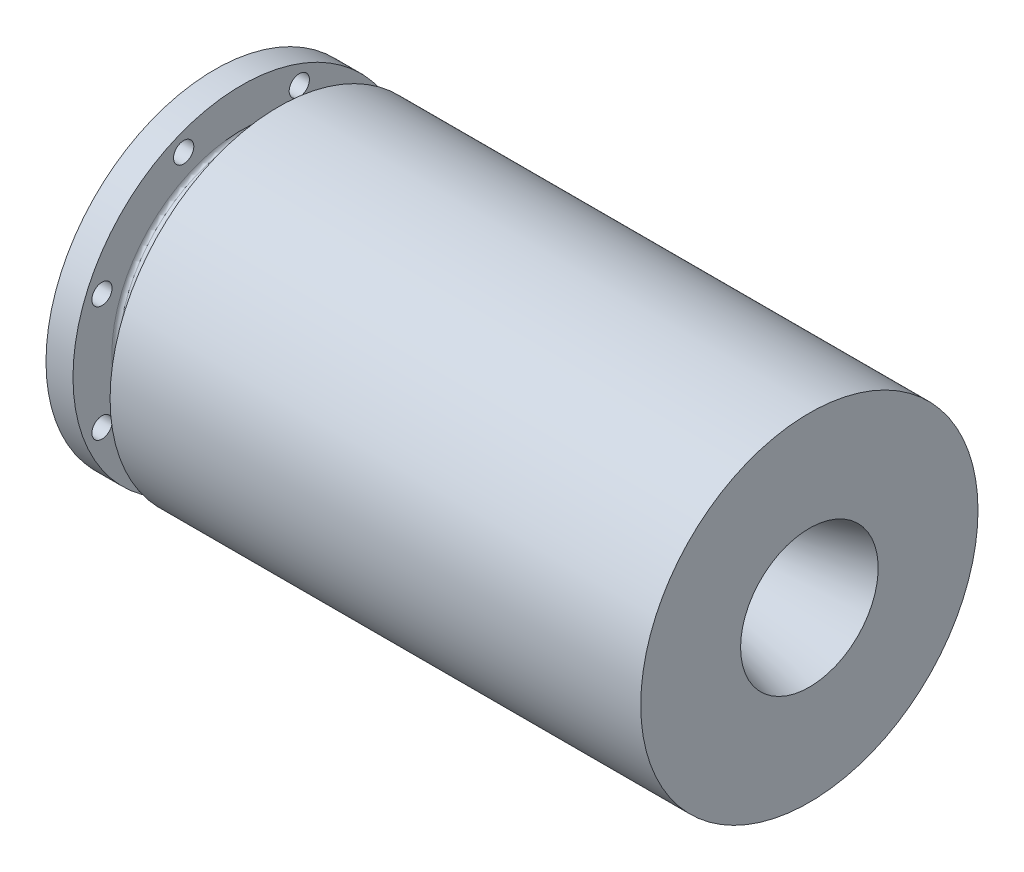
ISO-10303-21;
HEADER;
FILE_DESCRIPTION(('STEP AP214'),'2;1');
FILE_NAME('part.step','',(''),(''),'','','');
FILE_SCHEMA(('AUTOMOTIVE_DESIGN { 1 0 10303 214 1 1 1 1 }'));
ENDSEC;
DATA;
#1=APPLICATION_CONTEXT('core data for automotive mechanical design processes');
#2=APPLICATION_PROTOCOL_DEFINITION('international standard','automotive_design',2000,#1);
#3=PRODUCT_CONTEXT('',#1,'mechanical');
#4=PRODUCT('Part','Part','',(#3));
#5=PRODUCT_RELATED_PRODUCT_CATEGORY('part','',(#4));
#6=PRODUCT_DEFINITION_FORMATION('','',#4);
#7=PRODUCT_DEFINITION_CONTEXT('part definition',#1,'design');
#8=PRODUCT_DEFINITION('design','',#6,#7);
#9=PRODUCT_DEFINITION_SHAPE('','',#8);
#10=(LENGTH_UNIT() NAMED_UNIT(*) SI_UNIT(.MILLI.,.METRE.));
#11=(NAMED_UNIT(*) PLANE_ANGLE_UNIT() SI_UNIT($,.RADIAN.));
#12=(NAMED_UNIT(*) SI_UNIT($,.STERADIAN.) SOLID_ANGLE_UNIT());
#13=UNCERTAINTY_MEASURE_WITH_UNIT(LENGTH_MEASURE(1.E-05),#10,'distance_accuracy_value','');
#14=(GEOMETRIC_REPRESENTATION_CONTEXT(3) GLOBAL_UNCERTAINTY_ASSIGNED_CONTEXT((#13)) GLOBAL_UNIT_ASSIGNED_CONTEXT((#10,
#11,#12)) REPRESENTATION_CONTEXT('',''));
#15=CARTESIAN_POINT('',(0.,0.,0.));
#16=DIRECTION('',(0.,0.,1.));
#17=DIRECTION('',(1.,0.,0.));
#18=AXIS2_PLACEMENT_3D('',#15,#16,#17);
#19=CARTESIAN_POINT('',(0.,0.,0.));
#20=DIRECTION('',(-1.,0.,0.));
#21=DIRECTION('',(0.,0.,1.));
#22=AXIS2_PLACEMENT_3D('',#19,#20,#21);
#23=CYLINDRICAL_SURFACE('',#22,47.5996);
#24=CARTESIAN_POINT('',(22.86,0.,0.));
#25=DIRECTION('',(1.,0.,0.));
#26=DIRECTION('',(0.,0.,-1.));
#27=AXIS2_PLACEMENT_3D('',#24,#25,#26);
#28=CIRCLE('',#27,47.5996);
#29=CARTESIAN_POINT('',(22.86,0.,-47.5996));
#30=VERTEX_POINT('',#29);
#31=EDGE_CURVE('E62',#30,#30,#28,.F.);
#32=ORIENTED_EDGE('',*,*,#31,.T.);
#33=EDGE_LOOP('',(#32));
#34=FACE_BOUND('',#33,.T.);
#35=CARTESIAN_POINT('',(11.43,0.,0.));
#36=DIRECTION('',(-1.,0.,0.));
#37=DIRECTION('',(0.,0.,1.));
#38=AXIS2_PLACEMENT_3D('',#35,#36,#37);
#39=CIRCLE('',#38,47.5996);
#40=CARTESIAN_POINT('',(11.43,0.,47.5996));
#41=VERTEX_POINT('',#40);
#42=EDGE_CURVE('E65',#41,#41,#39,.F.);
#43=ORIENTED_EDGE('',*,*,#42,.T.);
#44=EDGE_LOOP('',(#43));
#45=FACE_BOUND('',#44,.T.);
#46=ADVANCED_FACE('F36',(#34,#45),#23,.T.);
#47=CARTESIAN_POINT('',(10.16,63.5,0.));
#48=DIRECTION('',(-1.,0.,0.));
#49=DIRECTION('',(0.,0.,1.));
#50=AXIS2_PLACEMENT_3D('',#47,#48,#49);
#51=PLANE('',#50);
#52=CARTESIAN_POINT('',(10.16,52.5460292053547,21.8190199310146));
#53=DIRECTION('',(-1.,0.,0.));
#54=DIRECTION('',(0.,0.,1.));
#55=AXIS2_PLACEMENT_3D('',#52,#53,#54);
#56=CIRCLE('',#55,3.81);
#57=CARTESIAN_POINT('',(10.16,52.5460292053547,25.6290199310146));
#58=VERTEX_POINT('',#57);
#59=EDGE_CURVE('E105',#58,#58,#56,.F.);
#60=ORIENTED_EDGE('',*,*,#59,.F.);
#61=EDGE_LOOP('',(#60));
#62=FACE_BOUND('',#61,.T.);
#63=CARTESIAN_POINT('',(10.16,21.7272766234677,52.5840305275976));
#64=DIRECTION('',(-1.,0.,0.));
#65=DIRECTION('',(0.,0.,1.));
#66=AXIS2_PLACEMENT_3D('',#63,#64,#65);
#67=CIRCLE('',#66,3.81);
#68=CARTESIAN_POINT('',(10.16,21.7272766234677,56.3940305275976));
#69=VERTEX_POINT('',#68);
#70=EDGE_CURVE('E141',#69,#69,#67,.F.);
#71=ORIENTED_EDGE('',*,*,#70,.F.);
#72=EDGE_LOOP('',(#71));
#73=FACE_BOUND('',#72,.T.);
#74=CARTESIAN_POINT('',(10.16,-21.8190199310148,52.5460292053546));
#75=DIRECTION('',(-1.,0.,0.));
#76=DIRECTION('',(0.,0.,1.));
#77=AXIS2_PLACEMENT_3D('',#74,#75,#76);
#78=CIRCLE('',#77,3.81);
#79=CARTESIAN_POINT('',(10.16,-21.8190199310148,56.3560292053546));
#80=VERTEX_POINT('',#79);
#81=EDGE_CURVE('E135',#80,#80,#78,.F.);
#82=ORIENTED_EDGE('',*,*,#81,.F.);
#83=EDGE_LOOP('',(#82));
#84=FACE_BOUND('',#83,.T.);
#85=CARTESIAN_POINT('',(10.16,-52.5840305275975,21.7272766234679));
#86=DIRECTION('',(-1.,0.,0.));
#87=DIRECTION('',(0.,0.,1.));
#88=AXIS2_PLACEMENT_3D('',#85,#86,#87);
#89=CIRCLE('',#88,3.81);
#90=CARTESIAN_POINT('',(10.16,-52.5840305275975,25.5372766234679));
#91=VERTEX_POINT('',#90);
#92=EDGE_CURVE('E129',#91,#91,#89,.F.);
#93=ORIENTED_EDGE('',*,*,#92,.F.);
#94=EDGE_LOOP('',(#93));
#95=FACE_BOUND('',#94,.T.);
#96=CARTESIAN_POINT('',(10.16,-52.5460292053545,-21.819019931015));
#97=DIRECTION('',(-1.,0.,0.));
#98=DIRECTION('',(0.,0.,1.));
#99=AXIS2_PLACEMENT_3D('',#96,#97,#98);
#100=CIRCLE('',#99,3.81);
#101=CARTESIAN_POINT('',(10.16,-52.5460292053545,-18.009019931015));
#102=VERTEX_POINT('',#101);
#103=EDGE_CURVE('E123',#102,#102,#100,.F.);
#104=ORIENTED_EDGE('',*,*,#103,.F.);
#105=EDGE_LOOP('',(#104));
#106=FACE_BOUND('',#105,.T.);
#107=CARTESIAN_POINT('',(10.16,-21.7272766234673,-52.5840305275977));
#108=DIRECTION('',(-1.,0.,0.));
#109=DIRECTION('',(0.,0.,1.));
#110=AXIS2_PLACEMENT_3D('',#107,#108,#109);
#111=CIRCLE('',#110,3.81);
#112=CARTESIAN_POINT('',(10.16,-21.7272766234673,-48.7740305275977));
#113=VERTEX_POINT('',#112);
#114=EDGE_CURVE('E117',#113,#113,#111,.F.);
#115=ORIENTED_EDGE('',*,*,#114,.F.);
#116=EDGE_LOOP('',(#115));
#117=FACE_BOUND('',#116,.T.);
#118=CARTESIAN_POINT('',(10.16,21.8190199310152,-52.5460292053544));
#119=DIRECTION('',(-1.,0.,0.));
#120=DIRECTION('',(0.,0.,1.));
#121=AXIS2_PLACEMENT_3D('',#118,#119,#120);
#122=CIRCLE('',#121,3.81);
#123=CARTESIAN_POINT('',(10.16,21.8190199310152,-48.7360292053544));
#124=VERTEX_POINT('',#123);
#125=EDGE_CURVE('E111',#124,#124,#122,.F.);
#126=ORIENTED_EDGE('',*,*,#125,.F.);
#127=EDGE_LOOP('',(#126));
#128=FACE_BOUND('',#127,.T.);
#129=CARTESIAN_POINT('',(10.16,52.5840305275975,-21.7272766234679));
#130=DIRECTION('',(-1.,0.,0.));
#131=DIRECTION('',(0.,0.,1.));
#132=AXIS2_PLACEMENT_3D('',#129,#130,#131);
#133=CIRCLE('',#132,3.81);
#134=CARTESIAN_POINT('',(10.16,52.5840305275975,-17.9172766234679));
#135=VERTEX_POINT('',#134);
#136=EDGE_CURVE('E101',#135,#135,#133,.F.);
#137=ORIENTED_EDGE('',*,*,#136,.F.);
#138=EDGE_LOOP('',(#137));
#139=FACE_BOUND('',#138,.T.);
#140=CARTESIAN_POINT('',(10.16,0.,0.));
#141=DIRECTION('',(-1.,0.,0.));
#142=DIRECTION('',(0.,0.,1.));
#143=AXIS2_PLACEMENT_3D('',#140,#141,#142);
#144=CIRCLE('',#143,48.8696);
#145=CARTESIAN_POINT('',(10.16,0.,48.8696));
#146=VERTEX_POINT('',#145);
#147=EDGE_CURVE('E56',#146,#146,#144,.T.);
#148=ORIENTED_EDGE('',*,*,#147,.T.);
#149=EDGE_LOOP('',(#148));
#150=FACE_BOUND('',#149,.T.);
#151=CARTESIAN_POINT('',(10.16,0.,0.));
#152=DIRECTION('',(-1.,0.,0.));
#153=DIRECTION('',(0.,0.,1.));
#154=AXIS2_PLACEMENT_3D('',#151,#152,#153);
#155=CIRCLE('',#154,63.5);
#156=CARTESIAN_POINT('',(10.16,0.,63.5));
#157=VERTEX_POINT('',#156);
#158=EDGE_CURVE('E68',#157,#157,#155,.T.);
#159=ORIENTED_EDGE('',*,*,#158,.F.);
#160=EDGE_LOOP('',(#159));
#161=FACE_BOUND('',#160,.T.);
#162=ADVANCED_FACE('F152',(#62,#73,#84,#95,#106,#117,#128,#139,#150,#161),#51,.F.);
#163=CARTESIAN_POINT('',(0.,0.,0.));
#164=DIRECTION('',(-1.,0.,0.));
#165=DIRECTION('',(0.,0.,1.));
#166=AXIS2_PLACEMENT_3D('',#163,#164,#165);
#167=CYLINDRICAL_SURFACE('',#166,63.5);
#168=CARTESIAN_POINT('',(0.,0.,0.));
#169=DIRECTION('',(-1.,0.,0.));
#170=DIRECTION('',(0.,0.,1.));
#171=AXIS2_PLACEMENT_3D('',#168,#169,#170);
#172=CIRCLE('',#171,63.5);
#173=CARTESIAN_POINT('',(0.,0.,63.5));
#174=VERTEX_POINT('',#173);
#175=EDGE_CURVE('E71',#174,#174,#172,.T.);
#176=ORIENTED_EDGE('',*,*,#175,.F.);
#177=EDGE_LOOP('',(#176));
#178=FACE_BOUND('',#177,.T.);
#179=ORIENTED_EDGE('',*,*,#158,.T.);
#180=EDGE_LOOP('',(#179));
#181=FACE_BOUND('',#180,.T.);
#182=ADVANCED_FACE('F155',(#178,#181),#167,.T.);
#183=CARTESIAN_POINT('',(0.,48.5902,0.));
#184=DIRECTION('',(1.,0.,0.));
#185=DIRECTION('',(0.,0.,-1.));
#186=AXIS2_PLACEMENT_3D('',#183,#184,#185);
#187=PLANE('',#186);
#188=CARTESIAN_POINT('',(0.,52.5460292053547,21.8190199310146));
#189=DIRECTION('',(-1.,0.,0.));
#190=DIRECTION('',(0.,-0.707106781186549,0.707106781186546));
#191=AXIS2_PLACEMENT_3D('',#188,#189,#190);
#192=CIRCLE('',#191,3.81);
#193=CARTESIAN_POINT('',(0.,49.8519523690339,24.5130967673354));
#194=VERTEX_POINT('',#193);
#195=EDGE_CURVE('E144',#194,#194,#192,.T.);
#196=ORIENTED_EDGE('',*,*,#195,.F.);
#197=EDGE_LOOP('',(#196));
#198=FACE_BOUND('',#197,.T.);
#199=CARTESIAN_POINT('',(0.,21.7272766234677,52.5840305275976));
#200=DIRECTION('',(-1.,0.,0.));
#201=DIRECTION('',(0.,-1.,0.));
#202=AXIS2_PLACEMENT_3D('',#199,#200,#201);
#203=CIRCLE('',#202,3.81);
#204=CARTESIAN_POINT('',(0.,17.9172766234677,52.5840305275976));
#205=VERTEX_POINT('',#204);
#206=EDGE_CURVE('E138',#205,#205,#203,.T.);
#207=ORIENTED_EDGE('',*,*,#206,.F.);
#208=EDGE_LOOP('',(#207));
#209=FACE_BOUND('',#208,.T.);
#210=CARTESIAN_POINT('',(0.,-21.8190199310148,52.5460292053546));
#211=DIRECTION('',(-1.,0.,0.));
#212=DIRECTION('',(0.,-0.707106781186544,-0.707106781186551));
#213=AXIS2_PLACEMENT_3D('',#210,#211,#212);
#214=CIRCLE('',#213,3.81);
#215=CARTESIAN_POINT('',(0.,-24.5130967673356,49.8519523690338));
#216=VERTEX_POINT('',#215);
#217=EDGE_CURVE('E132',#216,#216,#214,.T.);
#218=ORIENTED_EDGE('',*,*,#217,.F.);
#219=EDGE_LOOP('',(#218));
#220=FACE_BOUND('',#219,.T.);
#221=CARTESIAN_POINT('',(0.,-52.5840305275975,21.7272766234679));
#222=DIRECTION('',(-1.,0.,0.));
#223=DIRECTION('',(0.,0.,-1.));
#224=AXIS2_PLACEMENT_3D('',#221,#222,#223);
#225=CIRCLE('',#224,3.81);
#226=CARTESIAN_POINT('',(0.,-52.5840305275975,17.9172766234679));
#227=VERTEX_POINT('',#226);
#228=EDGE_CURVE('E126',#227,#227,#225,.T.);
#229=ORIENTED_EDGE('',*,*,#228,.F.);
#230=EDGE_LOOP('',(#229));
#231=FACE_BOUND('',#230,.T.);
#232=CARTESIAN_POINT('',(0.,-52.5460292053545,-21.819019931015));
#233=DIRECTION('',(-1.,0.,0.));
#234=DIRECTION('',(0.,0.707106781186554,-0.707106781186541));
#235=AXIS2_PLACEMENT_3D('',#232,#233,#234);
#236=CIRCLE('',#235,3.81);
#237=CARTESIAN_POINT('',(0.,-49.8519523690338,-24.5130967673357));
#238=VERTEX_POINT('',#237);
#239=EDGE_CURVE('E120',#238,#238,#236,.T.);
#240=ORIENTED_EDGE('',*,*,#239,.F.);
#241=EDGE_LOOP('',(#240));
#242=FACE_BOUND('',#241,.T.);
#243=CARTESIAN_POINT('',(0.,-21.7272766234673,-52.5840305275977));
#244=DIRECTION('',(-1.,0.,0.));
#245=DIRECTION('',(0.,1.,0.));
#246=AXIS2_PLACEMENT_3D('',#243,#244,#245);
#247=CIRCLE('',#246,3.81);
#248=CARTESIAN_POINT('',(0.,-17.9172766234673,-52.5840305275977));
#249=VERTEX_POINT('',#248);
#250=EDGE_CURVE('E114',#249,#249,#247,.T.);
#251=ORIENTED_EDGE('',*,*,#250,.F.);
#252=EDGE_LOOP('',(#251));
#253=FACE_BOUND('',#252,.T.);
#254=CARTESIAN_POINT('',(0.,21.8190199310152,-52.5460292053544));
#255=DIRECTION('',(-1.,0.,0.));
#256=DIRECTION('',(0.,0.707106781186539,0.707106781186556));
#257=AXIS2_PLACEMENT_3D('',#254,#255,#256);
#258=CIRCLE('',#257,3.81);
#259=CARTESIAN_POINT('',(0.,24.5130967673359,-49.8519523690337));
#260=VERTEX_POINT('',#259);
#261=EDGE_CURVE('E108',#260,#260,#258,.T.);
#262=ORIENTED_EDGE('',*,*,#261,.F.);
#263=EDGE_LOOP('',(#262));
#264=FACE_BOUND('',#263,.T.);
#265=CARTESIAN_POINT('',(0.,52.5840305275975,-21.7272766234679));
#266=DIRECTION('',(-1.,0.,0.));
#267=DIRECTION('',(0.,0.,1.));
#268=AXIS2_PLACEMENT_3D('',#265,#266,#267);
#269=CIRCLE('',#268,3.81);
#270=CARTESIAN_POINT('',(0.,52.5840305275975,-17.9172766234679));
#271=VERTEX_POINT('',#270);
#272=EDGE_CURVE('E102',#271,#271,#269,.T.);
#273=ORIENTED_EDGE('',*,*,#272,.F.);
#274=EDGE_LOOP('',(#273));
#275=FACE_BOUND('',#274,.T.);
#276=CARTESIAN_POINT('',(0.,0.,0.));
#277=DIRECTION('',(-1.,0.,0.));
#278=DIRECTION('',(0.,0.,1.));
#279=AXIS2_PLACEMENT_3D('',#276,#277,#278);
#280=CIRCLE('',#279,48.5902);
#281=CARTESIAN_POINT('',(0.,0.,48.5902));
#282=VERTEX_POINT('',#281);
#283=EDGE_CURVE('E74',#282,#282,#280,.T.);
#284=ORIENTED_EDGE('',*,*,#283,.F.);
#285=EDGE_LOOP('',(#284));
#286=FACE_BOUND('',#285,.T.);
#287=ORIENTED_EDGE('',*,*,#175,.T.);
#288=EDGE_LOOP('',(#287));
#289=FACE_BOUND('',#288,.T.);
#290=ADVANCED_FACE('F176',(#198,#209,#220,#231,#242,#253,#264,#275,#286,#289),#187,.F.);
#291=CARTESIAN_POINT('',(0.,0.,0.));
#292=DIRECTION('',(-1.,0.,0.));
#293=DIRECTION('',(0.,0.,1.));
#294=AXIS2_PLACEMENT_3D('',#291,#292,#293);
#295=CYLINDRICAL_SURFACE('',#294,48.5902);
#296=CARTESIAN_POINT('',(2.9718,0.,0.));
#297=DIRECTION('',(1.,0.,0.));
#298=DIRECTION('',(0.,0.,-1.));
#299=AXIS2_PLACEMENT_3D('',#296,#297,#298);
#300=CIRCLE('',#299,48.5902);
#301=CARTESIAN_POINT('',(2.9718,0.,-48.5902));
#302=VERTEX_POINT('',#301);
#303=EDGE_CURVE('E10',#302,#302,#300,.T.);
#304=ORIENTED_EDGE('',*,*,#303,.T.);
#305=EDGE_LOOP('',(#304));
#306=FACE_BOUND('',#305,.T.);
#307=ORIENTED_EDGE('',*,*,#283,.T.);
#308=EDGE_LOOP('',(#307));
#309=FACE_BOUND('',#308,.T.);
#310=ADVANCED_FACE('F182',(#306,#309),#295,.F.);
#311=CARTESIAN_POINT('',(3.8608,48.5902,0.));
#312=DIRECTION('',(1.,0.,0.));
#313=DIRECTION('',(0.,0.,-1.));
#314=AXIS2_PLACEMENT_3D('',#311,#312,#313);
#315=PLANE('',#314);
#316=CARTESIAN_POINT('',(3.8608,0.,0.));
#317=DIRECTION('',(1.,0.,0.));
#318=DIRECTION('',(0.,0.,-1.));
#319=AXIS2_PLACEMENT_3D('',#316,#317,#318);
#320=CIRCLE('',#319,43.4086);
#321=CARTESIAN_POINT('',(3.8608,0.,-43.4086));
#322=VERTEX_POINT('',#321);
#323=EDGE_CURVE('E43',#322,#322,#320,.T.);
#324=ORIENTED_EDGE('',*,*,#323,.T.);
#325=EDGE_LOOP('',(#324));
#326=FACE_BOUND('',#325,.T.);
#327=CARTESIAN_POINT('',(3.8608,0.,0.));
#328=DIRECTION('',(1.,0.,0.));
#329=DIRECTION('',(0.,0.,-1.));
#330=AXIS2_PLACEMENT_3D('',#327,#328,#329);
#331=CIRCLE('',#330,47.7012);
#332=CARTESIAN_POINT('',(3.8608,0.,-47.7012));
#333=VERTEX_POINT('',#332);
#334=EDGE_CURVE('E47',#333,#333,#331,.F.);
#335=ORIENTED_EDGE('',*,*,#334,.T.);
#336=EDGE_LOOP('',(#335));
#337=FACE_BOUND('',#336,.T.);
#338=ADVANCED_FACE('F220',(#326,#337),#315,.F.);
#339=CARTESIAN_POINT('',(0.,0.,0.));
#340=DIRECTION('',(-1.,0.,0.));
#341=DIRECTION('',(0.,0.,1.));
#342=AXIS2_PLACEMENT_3D('',#339,#340,#341);
#343=CYLINDRICAL_SURFACE('',#342,42.5196);
#344=CARTESIAN_POINT('',(2.9718,0.,0.));
#345=DIRECTION('',(1.,0.,0.));
#346=DIRECTION('',(0.,0.,-1.));
#347=AXIS2_PLACEMENT_3D('',#344,#345,#346);
#348=CIRCLE('',#347,42.5196);
#349=CARTESIAN_POINT('',(2.9718,0.,-42.5196));
#350=VERTEX_POINT('',#349);
#351=EDGE_CURVE('E51',#350,#350,#348,.F.);
#352=ORIENTED_EDGE('',*,*,#351,.T.);
#353=EDGE_LOOP('',(#352));
#354=FACE_BOUND('',#353,.T.);
#355=CARTESIAN_POINT('',(0.,0.,0.));
#356=DIRECTION('',(-1.,0.,0.));
#357=DIRECTION('',(0.,0.,1.));
#358=AXIS2_PLACEMENT_3D('',#355,#356,#357);
#359=CIRCLE('',#358,42.5196);
#360=CARTESIAN_POINT('',(0.,0.,42.5196));
#361=VERTEX_POINT('',#360);
#362=EDGE_CURVE('E77',#361,#361,#359,.T.);
#363=ORIENTED_EDGE('',*,*,#362,.F.);
#364=EDGE_LOOP('',(#363));
#365=FACE_BOUND('',#364,.T.);
#366=ADVANCED_FACE('F216',(#354,#365),#343,.T.);
#367=CARTESIAN_POINT('',(0.,33.8836,0.));
#368=DIRECTION('',(1.,0.,0.));
#369=DIRECTION('',(0.,0.,-1.));
#370=AXIS2_PLACEMENT_3D('',#367,#368,#369);
#371=PLANE('',#370);
#372=CARTESIAN_POINT('',(0.,0.,0.));
#373=DIRECTION('',(-1.,0.,0.));
#374=DIRECTION('',(0.,0.,1.));
#375=AXIS2_PLACEMENT_3D('',#372,#373,#374);
#376=CIRCLE('',#375,33.8836);
#377=CARTESIAN_POINT('',(0.,0.,33.8836));
#378=VERTEX_POINT('',#377);
#379=EDGE_CURVE('E80',#378,#378,#376,.T.);
#380=ORIENTED_EDGE('',*,*,#379,.F.);
#381=EDGE_LOOP('',(#380));
#382=FACE_BOUND('',#381,.T.);
#383=ORIENTED_EDGE('',*,*,#362,.T.);
#384=EDGE_LOOP('',(#383));
#385=FACE_BOUND('',#384,.T.);
#386=ADVANCED_FACE('F219',(#382,#385),#371,.F.);
#387=CARTESIAN_POINT('',(0.,0.,0.));
#388=DIRECTION('',(-1.,0.,0.));
#389=DIRECTION('',(0.,0.,1.));
#390=AXIS2_PLACEMENT_3D('',#387,#388,#389);
#391=CYLINDRICAL_SURFACE('',#390,33.8836);
#392=CARTESIAN_POINT('',(173.5582,0.,0.));
#393=DIRECTION('',(-1.,0.,0.));
#394=DIRECTION('',(0.,0.,1.));
#395=AXIS2_PLACEMENT_3D('',#392,#393,#394);
#396=CIRCLE('',#395,33.8836);
#397=CARTESIAN_POINT('',(173.5582,0.,33.8836));
#398=VERTEX_POINT('',#397);
#399=EDGE_CURVE('E83',#398,#398,#396,.T.);
#400=ORIENTED_EDGE('',*,*,#399,.F.);
#401=EDGE_LOOP('',(#400));
#402=FACE_BOUND('',#401,.T.);
#403=ORIENTED_EDGE('',*,*,#379,.T.);
#404=EDGE_LOOP('',(#403));
#405=FACE_BOUND('',#404,.T.);
#406=ADVANCED_FACE('F225',(#402,#405),#391,.F.);
#407=CARTESIAN_POINT('',(173.5582,0.,0.));
#408=DIRECTION('',(-1.,0.,0.));
#409=DIRECTION('',(0.,0.,1.));
#410=AXIS2_PLACEMENT_3D('',#407,#408,#409);
#411=CONICAL_SURFACE('',#410,33.8836,0.785398163397442);
#412=CARTESIAN_POINT('',(189.463049342222,0.,0.));
#413=DIRECTION('',(-1.,0.,0.));
#414=DIRECTION('',(0.,0.,1.));
#415=AXIS2_PLACEMENT_3D('',#412,#413,#414);
#416=CIRCLE('',#415,17.9787506577782);
#417=CARTESIAN_POINT('',(189.463049342222,0.,17.9787506577782));
#418=VERTEX_POINT('',#417);
#419=EDGE_CURVE('E86',#418,#418,#416,.T.);
#420=ORIENTED_EDGE('',*,*,#419,.F.);
#421=EDGE_LOOP('',(#420));
#422=FACE_BOUND('',#421,.T.);
#423=ORIENTED_EDGE('',*,*,#399,.T.);
#424=EDGE_LOOP('',(#423));
#425=FACE_BOUND('',#424,.T.);
#426=ADVANCED_FACE('F231',(#422,#425),#411,.F.);
#427=CARTESIAN_POINT('',(191.259100566436,0.,0.));
#428=DIRECTION('',(-1.,0.,0.));
#429=DIRECTION('',(0.,0.,1.));
#430=AXIS2_PLACEMENT_3D('',#427,#428,#429);
#431=TOROIDAL_SURFACE('',#430,19.774801881992,2.54);
#432=CARTESIAN_POINT('',(191.916500940996,0.,0.));
#433=DIRECTION('',(-1.,0.,0.));
#434=DIRECTION('',(0.,0.,1.));
#435=AXIS2_PLACEMENT_3D('',#432,#433,#434);
#436=CIRCLE('',#435,17.3213502832178);
#437=CARTESIAN_POINT('',(191.916500940996,0.,17.3213502832178));
#438=VERTEX_POINT('',#437);
#439=EDGE_CURVE('E89',#438,#438,#436,.T.);
#440=ORIENTED_EDGE('',*,*,#439,.F.);
#441=EDGE_LOOP('',(#440));
#442=FACE_BOUND('',#441,.T.);
#443=ORIENTED_EDGE('',*,*,#419,.T.);
#444=EDGE_LOOP('',(#443));
#445=FACE_BOUND('',#444,.T.);
#446=ADVANCED_FACE('F282',(#442,#445),#431,.T.);
#447=CARTESIAN_POINT('',(191.916500940996,0.,0.));
#448=DIRECTION('',(1.,0.,0.));
#449=DIRECTION('',(0.,0.,-1.));
#450=AXIS2_PLACEMENT_3D('',#447,#448,#449);
#451=CONICAL_SURFACE('',#450,17.3213502832178,0.26179938779915);
#452=CARTESIAN_POINT('',(223.962313950824,0.,0.));
#453=DIRECTION('',(-1.,0.,0.));
#454=DIRECTION('',(0.,0.,1.));
#455=AXIS2_PLACEMENT_3D('',#452,#453,#454);
#456=CIRCLE('',#455,25.908);
#457=CARTESIAN_POINT('',(223.962313950824,0.,25.908));
#458=VERTEX_POINT('',#457);
#459=EDGE_CURVE('E92',#458,#458,#456,.T.);
#460=ORIENTED_EDGE('',*,*,#459,.F.);
#461=EDGE_LOOP('',(#460));
#462=FACE_BOUND('',#461,.T.);
#463=ORIENTED_EDGE('',*,*,#439,.T.);
#464=EDGE_LOOP('',(#463));
#465=FACE_BOUND('',#464,.T.);
#466=ADVANCED_FACE('F292',(#462,#465),#451,.F.);
#467=CARTESIAN_POINT('',(223.962313950824,63.5,0.));
#468=DIRECTION('',(-1.,0.,0.));
#469=DIRECTION('',(0.,0.,1.));
#470=AXIS2_PLACEMENT_3D('',#467,#468,#469);
#471=PLANE('',#470);
#472=CARTESIAN_POINT('',(223.962313950824,0.,0.));
#473=DIRECTION('',(-1.,0.,0.));
#474=DIRECTION('',(0.,0.,1.));
#475=AXIS2_PLACEMENT_3D('',#472,#473,#474);
#476=CIRCLE('',#475,63.5);
#477=CARTESIAN_POINT('',(223.962313950824,0.,63.5));
#478=VERTEX_POINT('',#477);
#479=EDGE_CURVE('E95',#478,#478,#476,.T.);
#480=ORIENTED_EDGE('',*,*,#479,.F.);
#481=EDGE_LOOP('',(#480));
#482=FACE_BOUND('',#481,.T.);
#483=ORIENTED_EDGE('',*,*,#459,.T.);
#484=EDGE_LOOP('',(#483));
#485=FACE_BOUND('',#484,.T.);
#486=ADVANCED_FACE('F303',(#482,#485),#471,.F.);
#487=CARTESIAN_POINT('',(0.,0.,0.));
#488=DIRECTION('',(-1.,0.,0.));
#489=DIRECTION('',(0.,0.,1.));
#490=AXIS2_PLACEMENT_3D('',#487,#488,#489);
#491=CYLINDRICAL_SURFACE('',#490,63.5);
#492=CARTESIAN_POINT('',(24.13,0.,0.));
#493=DIRECTION('',(-1.,0.,0.));
#494=DIRECTION('',(0.,0.,1.));
#495=AXIS2_PLACEMENT_3D('',#492,#493,#494);
#496=CIRCLE('',#495,63.5);
#497=CARTESIAN_POINT('',(24.13,0.,63.5));
#498=VERTEX_POINT('',#497);
#499=EDGE_CURVE('E98',#498,#498,#496,.T.);
#500=ORIENTED_EDGE('',*,*,#499,.F.);
#501=EDGE_LOOP('',(#500));
#502=FACE_BOUND('',#501,.T.);
#503=ORIENTED_EDGE('',*,*,#479,.T.);
#504=EDGE_LOOP('',(#503));
#505=FACE_BOUND('',#504,.T.);
#506=ADVANCED_FACE('F314',(#502,#505),#491,.T.);
#507=CARTESIAN_POINT('',(24.13,47.5996,0.));
#508=DIRECTION('',(1.,0.,0.));
#509=DIRECTION('',(0.,0.,-1.));
#510=AXIS2_PLACEMENT_3D('',#507,#508,#509);
#511=PLANE('',#510);
#512=CARTESIAN_POINT('',(24.13,0.,0.));
#513=DIRECTION('',(1.,0.,0.));
#514=DIRECTION('',(0.,0.,-1.));
#515=AXIS2_PLACEMENT_3D('',#512,#513,#514);
#516=CIRCLE('',#515,48.8696);
#517=CARTESIAN_POINT('',(24.13,0.,-48.8696));
#518=VERTEX_POINT('',#517);
#519=EDGE_CURVE('E59',#518,#518,#516,.T.);
#520=ORIENTED_EDGE('',*,*,#519,.T.);
#521=EDGE_LOOP('',(#520));
#522=FACE_BOUND('',#521,.T.);
#523=ORIENTED_EDGE('',*,*,#499,.T.);
#524=EDGE_LOOP('',(#523));
#525=FACE_BOUND('',#524,.T.);
#526=ADVANCED_FACE('F197',(#522,#525),#511,.F.);
#527=CARTESIAN_POINT('',(22.86,0.,0.));
#528=DIRECTION('',(1.,0.,0.));
#529=DIRECTION('',(0.,0.,-1.));
#530=AXIS2_PLACEMENT_3D('',#527,#528,#529);
#531=TOROIDAL_SURFACE('',#530,48.8696,1.27);
#532=ORIENTED_EDGE('',*,*,#519,.F.);
#533=EDGE_LOOP('',(#532));
#534=FACE_BOUND('',#533,.T.);
#535=ORIENTED_EDGE('',*,*,#31,.F.);
#536=EDGE_LOOP('',(#535));
#537=FACE_BOUND('',#536,.T.);
#538=ADVANCED_FACE('F193',(#534,#537),#531,.F.);
#539=CARTESIAN_POINT('',(11.43,0.,0.));
#540=DIRECTION('',(-1.,0.,0.));
#541=DIRECTION('',(0.,0.,1.));
#542=AXIS2_PLACEMENT_3D('',#539,#540,#541);
#543=TOROIDAL_SURFACE('',#542,48.8696,1.27);
#544=ORIENTED_EDGE('',*,*,#42,.F.);
#545=EDGE_LOOP('',(#544));
#546=FACE_BOUND('',#545,.T.);
#547=ORIENTED_EDGE('',*,*,#147,.F.);
#548=EDGE_LOOP('',(#547));
#549=FACE_BOUND('',#548,.T.);
#550=ADVANCED_FACE('F196',(#546,#549),#543,.F.);
#551=CARTESIAN_POINT('',(223.963313950824,52.5840305275975,-21.7272766234679));
#552=DIRECTION('',(-1.,0.,0.));
#553=DIRECTION('',(0.,0.,1.));
#554=AXIS2_PLACEMENT_3D('',#551,#552,#553);
#555=CYLINDRICAL_SURFACE('',#554,3.81);
#556=ORIENTED_EDGE('',*,*,#272,.T.);
#557=EDGE_LOOP('',(#556));
#558=FACE_BOUND('',#557,.T.);
#559=ORIENTED_EDGE('',*,*,#136,.T.);
#560=EDGE_LOOP('',(#559));
#561=FACE_BOUND('',#560,.T.);
#562=ADVANCED_FACE('F200',(#558,#561),#555,.F.);
#563=CARTESIAN_POINT('',(223.963313950824,21.8190199310152,-52.5460292053544));
#564=DIRECTION('',(-1.,0.,0.));
#565=DIRECTION('',(0.,0.,1.));
#566=AXIS2_PLACEMENT_3D('',#563,#564,#565);
#567=CYLINDRICAL_SURFACE('',#566,3.81);
#568=ORIENTED_EDGE('',*,*,#261,.T.);
#569=EDGE_LOOP('',(#568));
#570=FACE_BOUND('',#569,.T.);
#571=ORIENTED_EDGE('',*,*,#125,.T.);
#572=EDGE_LOOP('',(#571));
#573=FACE_BOUND('',#572,.T.);
#574=ADVANCED_FACE('F361',(#570,#573),#567,.F.);
#575=CARTESIAN_POINT('',(223.963313950824,-21.7272766234673,-52.5840305275977));
#576=DIRECTION('',(-1.,0.,0.));
#577=DIRECTION('',(0.,0.,1.));
#578=AXIS2_PLACEMENT_3D('',#575,#576,#577);
#579=CYLINDRICAL_SURFACE('',#578,3.81);
#580=ORIENTED_EDGE('',*,*,#250,.T.);
#581=EDGE_LOOP('',(#580));
#582=FACE_BOUND('',#581,.T.);
#583=ORIENTED_EDGE('',*,*,#114,.T.);
#584=EDGE_LOOP('',(#583));
#585=FACE_BOUND('',#584,.T.);
#586=ADVANCED_FACE('F372',(#582,#585),#579,.F.);
#587=CARTESIAN_POINT('',(223.963313950824,-52.5460292053545,-21.819019931015));
#588=DIRECTION('',(-1.,0.,0.));
#589=DIRECTION('',(0.,0.,1.));
#590=AXIS2_PLACEMENT_3D('',#587,#588,#589);
#591=CYLINDRICAL_SURFACE('',#590,3.81);
#592=ORIENTED_EDGE('',*,*,#239,.T.);
#593=EDGE_LOOP('',(#592));
#594=FACE_BOUND('',#593,.T.);
#595=ORIENTED_EDGE('',*,*,#103,.T.);
#596=EDGE_LOOP('',(#595));
#597=FACE_BOUND('',#596,.T.);
#598=ADVANCED_FACE('F383',(#594,#597),#591,.F.);
#599=CARTESIAN_POINT('',(223.963313950824,-52.5840305275975,21.7272766234679));
#600=DIRECTION('',(-1.,0.,0.));
#601=DIRECTION('',(0.,0.,1.));
#602=AXIS2_PLACEMENT_3D('',#599,#600,#601);
#603=CYLINDRICAL_SURFACE('',#602,3.81);
#604=ORIENTED_EDGE('',*,*,#228,.T.);
#605=EDGE_LOOP('',(#604));
#606=FACE_BOUND('',#605,.T.);
#607=ORIENTED_EDGE('',*,*,#92,.T.);
#608=EDGE_LOOP('',(#607));
#609=FACE_BOUND('',#608,.T.);
#610=ADVANCED_FACE('F394',(#606,#609),#603,.F.);
#611=CARTESIAN_POINT('',(223.963313950824,-21.8190199310148,52.5460292053546));
#612=DIRECTION('',(-1.,0.,0.));
#613=DIRECTION('',(0.,0.,1.));
#614=AXIS2_PLACEMENT_3D('',#611,#612,#613);
#615=CYLINDRICAL_SURFACE('',#614,3.81);
#616=ORIENTED_EDGE('',*,*,#217,.T.);
#617=EDGE_LOOP('',(#616));
#618=FACE_BOUND('',#617,.T.);
#619=ORIENTED_EDGE('',*,*,#81,.T.);
#620=EDGE_LOOP('',(#619));
#621=FACE_BOUND('',#620,.T.);
#622=ADVANCED_FACE('F405',(#618,#621),#615,.F.);
#623=CARTESIAN_POINT('',(223.963313950824,21.7272766234677,52.5840305275976));
#624=DIRECTION('',(-1.,0.,0.));
#625=DIRECTION('',(0.,0.,1.));
#626=AXIS2_PLACEMENT_3D('',#623,#624,#625);
#627=CYLINDRICAL_SURFACE('',#626,3.81);
#628=ORIENTED_EDGE('',*,*,#206,.T.);
#629=EDGE_LOOP('',(#628));
#630=FACE_BOUND('',#629,.T.);
#631=ORIENTED_EDGE('',*,*,#70,.T.);
#632=EDGE_LOOP('',(#631));
#633=FACE_BOUND('',#632,.T.);
#634=ADVANCED_FACE('F210',(#630,#633),#627,.F.);
#635=CARTESIAN_POINT('',(223.963313950824,52.5460292053547,21.8190199310146));
#636=DIRECTION('',(-1.,0.,0.));
#637=DIRECTION('',(0.,0.,1.));
#638=AXIS2_PLACEMENT_3D('',#635,#636,#637);
#639=CYLINDRICAL_SURFACE('',#638,3.81);
#640=ORIENTED_EDGE('',*,*,#195,.T.);
#641=EDGE_LOOP('',(#640));
#642=FACE_BOUND('',#641,.T.);
#643=ORIENTED_EDGE('',*,*,#59,.T.);
#644=EDGE_LOOP('',(#643));
#645=FACE_BOUND('',#644,.T.);
#646=ADVANCED_FACE('F150',(#642,#645),#639,.F.);
#647=CARTESIAN_POINT('',(2.9718,0.,0.));
#648=DIRECTION('',(1.,0.,0.));
#649=DIRECTION('',(0.,0.,-1.));
#650=AXIS2_PLACEMENT_3D('',#647,#648,#649);
#651=TOROIDAL_SURFACE('',#650,43.4086,0.889);
#652=ORIENTED_EDGE('',*,*,#323,.F.);
#653=EDGE_LOOP('',(#652));
#654=FACE_BOUND('',#653,.T.);
#655=ORIENTED_EDGE('',*,*,#351,.F.);
#656=EDGE_LOOP('',(#655));
#657=FACE_BOUND('',#656,.T.);
#658=ADVANCED_FACE('F202',(#654,#657),#651,.F.);
#659=CARTESIAN_POINT('',(2.9718,0.,0.));
#660=DIRECTION('',(1.,0.,0.));
#661=DIRECTION('',(0.,0.,-1.));
#662=AXIS2_PLACEMENT_3D('',#659,#660,#661);
#663=TOROIDAL_SURFACE('',#662,47.7012,0.889);
#664=ORIENTED_EDGE('',*,*,#303,.F.);
#665=EDGE_LOOP('',(#664));
#666=FACE_BOUND('',#665,.T.);
#667=ORIENTED_EDGE('',*,*,#334,.F.);
#668=EDGE_LOOP('',(#667));
#669=FACE_BOUND('',#668,.T.);
#670=ADVANCED_FACE('F38',(#666,#669),#663,.F.);
#671=CLOSED_SHELL('',(#46,#162,#182,#290,#310,#338,#366,#386,#406,#426,#446,#466,#486,#506,#526,
#538,#550,#562,#574,#586,#598,#610,#622,#634,#646,#658,#670));
#672=MANIFOLD_SOLID_BREP('B2',#671);
#673=ADVANCED_BREP_SHAPE_REPRESENTATION('',(#18,#672),#14);
#674=SHAPE_DEFINITION_REPRESENTATION(#9,#673);
ENDSEC;
END-ISO-10303-21;
